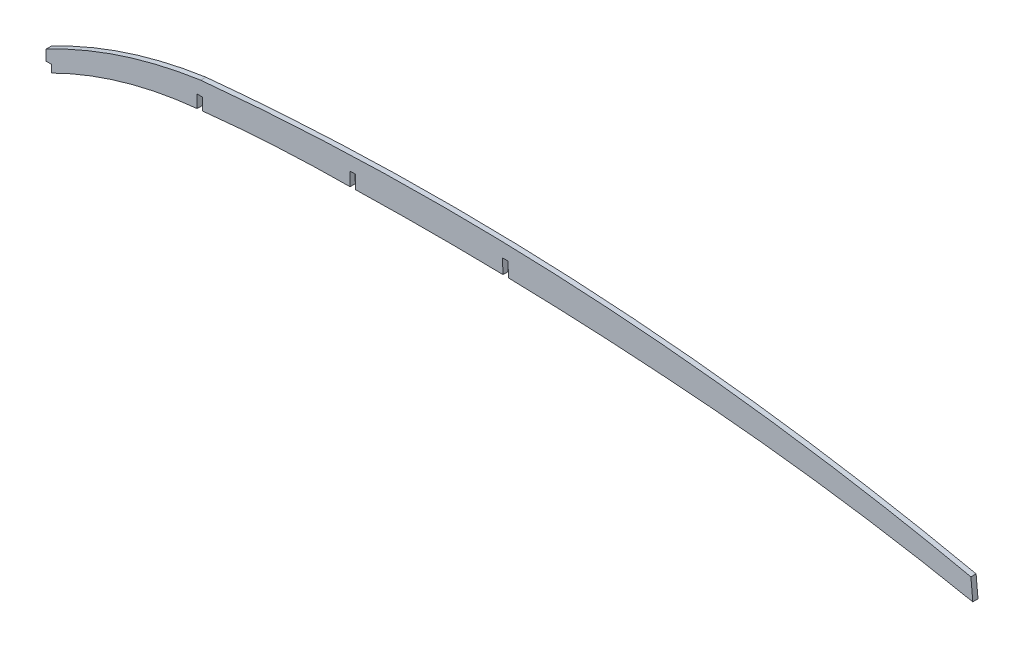
ISO-10303-21;
HEADER;
FILE_DESCRIPTION(('STEP AP214'),'2;1');
FILE_NAME('part.step','',(''),(''),'','','');
FILE_SCHEMA(('AUTOMOTIVE_DESIGN { 1 0 10303 214 1 1 1 1 }'));
ENDSEC;
DATA;
#1=APPLICATION_CONTEXT('core data for automotive mechanical design processes');
#2=APPLICATION_PROTOCOL_DEFINITION('international standard','automotive_design',2000,#1);
#3=PRODUCT_CONTEXT('',#1,'mechanical');
#4=PRODUCT('Part','Part','',(#3));
#5=PRODUCT_RELATED_PRODUCT_CATEGORY('part','',(#4));
#6=PRODUCT_DEFINITION_FORMATION('','',#4);
#7=PRODUCT_DEFINITION_CONTEXT('part definition',#1,'design');
#8=PRODUCT_DEFINITION('design','',#6,#7);
#9=PRODUCT_DEFINITION_SHAPE('','',#8);
#10=(LENGTH_UNIT() NAMED_UNIT(*) SI_UNIT(.MILLI.,.METRE.));
#11=(NAMED_UNIT(*) PLANE_ANGLE_UNIT() SI_UNIT($,.RADIAN.));
#12=(NAMED_UNIT(*) SI_UNIT($,.STERADIAN.) SOLID_ANGLE_UNIT());
#13=UNCERTAINTY_MEASURE_WITH_UNIT(LENGTH_MEASURE(1.E-05),#10,'distance_accuracy_value','');
#14=(GEOMETRIC_REPRESENTATION_CONTEXT(3) GLOBAL_UNCERTAINTY_ASSIGNED_CONTEXT((#13)) GLOBAL_UNIT_ASSIGNED_CONTEXT((#10,
#11,#12)) REPRESENTATION_CONTEXT('',''));
#15=CARTESIAN_POINT('',(0.,0.,0.));
#16=DIRECTION('',(0.,0.,1.));
#17=DIRECTION('',(1.,0.,0.));
#18=AXIS2_PLACEMENT_3D('',#15,#16,#17);
#19=CARTESIAN_POINT('',(236.842908731335,-1854.33285745886,-1.5875));
#20=DIRECTION('',(0.,0.,1.));
#21=DIRECTION('',(1.,0.,0.));
#22=AXIS2_PLACEMENT_3D('',#19,#20,#21);
#23=CYLINDRICAL_SURFACE('',#22,1973.72186122721);
#24=DIRECTION('',(0.,0.,1.));
#25=VECTOR('',#24,1.);
#26=CARTESIAN_POINT('',(189.115059370684,118.811850331623,-1.5875));
#27=LINE('',#26,#25);
#28=CARTESIAN_POINT('',(189.115059370684,118.811850331623,-1.5875));
#29=VERTEX_POINT('',#28);
#30=CARTESIAN_POINT('',(189.115059370684,118.811850331623,1.5875));
#31=VERTEX_POINT('',#30);
#32=EDGE_CURVE('E61',#29,#31,#27,.T.);
#33=ORIENTED_EDGE('',*,*,#32,.F.);
#34=CARTESIAN_POINT('',(236.842908731335,-1854.33285745886,-1.5875));
#35=DIRECTION('',(0.,0.,1.));
#36=DIRECTION('',(1.,0.,0.));
#37=AXIS2_PLACEMENT_3D('',#34,#35,#36);
#38=CIRCLE('',#37,1973.72186122721);
#39=CARTESIAN_POINT('',(279.152088981059,118.935476740212,-1.5875));
#40=VERTEX_POINT('',#39);
#41=EDGE_CURVE('E430',#29,#40,#38,.F.);
#42=ORIENTED_EDGE('',*,*,#41,.T.);
#43=DIRECTION('',(0.,0.,1.));
#44=VECTOR('',#43,1.);
#45=CARTESIAN_POINT('',(279.152088981059,118.935476740212,-1.5875));
#46=LINE('',#45,#44);
#47=CARTESIAN_POINT('',(279.152088981059,118.935476740212,1.5875));
#48=VERTEX_POINT('',#47);
#49=EDGE_CURVE('E238',#48,#40,#46,.F.);
#50=ORIENTED_EDGE('',*,*,#49,.F.);
#51=CARTESIAN_POINT('',(236.842908731335,-1854.33285745886,1.5875));
#52=DIRECTION('',(0.,0.,1.));
#53=DIRECTION('',(1.,0.,0.));
#54=AXIS2_PLACEMENT_3D('',#51,#52,#53);
#55=CIRCLE('',#54,1973.72186122721);
#56=EDGE_CURVE('E346',#31,#48,#55,.F.);
#57=ORIENTED_EDGE('',*,*,#56,.F.);
#58=EDGE_LOOP('',(#33,#42,#50,#57));
#59=FACE_BOUND('',#58,.T.);
#60=ADVANCED_FACE('F38',(#59),#23,.F.);
#61=CARTESIAN_POINT('',(569.494849028275,51.9104685304649,-1.5875));
#62=DIRECTION('',(0.995871386262189,0.0907754483559642,0.));
#63=DIRECTION('',(-0.0907754483559642,0.995871386262189,0.));
#64=AXIS2_PLACEMENT_3D('',#61,#62,#63);
#65=PLANE('',#64);
#66=DIRECTION('',(-0.0907754483559642,0.995871386262189,0.));
#67=VECTOR('',#66,1.);
#68=CARTESIAN_POINT('',(569.494849028275,51.9104685304649,1.5875));
#69=LINE('',#68,#67);
#70=CARTESIAN_POINT('',(566.085246421805,89.3162399786314,1.5875));
#71=VERTEX_POINT('',#70);
#72=CARTESIAN_POINT('',(564.932089986396,101.967188210855,1.5875));
#73=VERTEX_POINT('',#72);
#74=EDGE_CURVE('E269',#71,#73,#69,.T.);
#75=ORIENTED_EDGE('',*,*,#74,.F.);
#76=DIRECTION('',(0.,0.,1.));
#77=VECTOR('',#76,1.);
#78=CARTESIAN_POINT('',(566.085246421805,89.3162399786314,-1.5875));
#79=LINE('',#78,#77);
#80=CARTESIAN_POINT('',(566.085246421805,89.3162399786314,-1.5875));
#81=VERTEX_POINT('',#80);
#82=EDGE_CURVE('E318',#81,#71,#79,.T.);
#83=ORIENTED_EDGE('',*,*,#82,.F.);
#84=DIRECTION('',(-0.0907754483559642,0.995871386262189,0.));
#85=VECTOR('',#84,1.);
#86=CARTESIAN_POINT('',(569.494849028275,51.9104685304649,-1.5875));
#87=LINE('',#86,#85);
#88=CARTESIAN_POINT('',(564.932089986396,101.967188210855,-1.5875));
#89=VERTEX_POINT('',#88);
#90=EDGE_CURVE('E354',#81,#89,#87,.T.);
#91=ORIENTED_EDGE('',*,*,#90,.T.);
#92=DIRECTION('',(0.,0.,1.));
#93=VECTOR('',#92,1.);
#94=CARTESIAN_POINT('',(564.932089986396,101.967188210855,-1.5875));
#95=LINE('',#94,#93);
#96=EDGE_CURVE('E366',#89,#73,#95,.T.);
#97=ORIENTED_EDGE('',*,*,#96,.T.);
#98=EDGE_LOOP('',(#75,#83,#91,#97));
#99=FACE_BOUND('',#98,.T.);
#100=ADVANCED_FACE('F40',(#99),#65,.T.);
#101=CARTESIAN_POINT('',(283.231887302142,-1315.96010821101,-1.5875));
#102=DIRECTION('',(0.,0.,1.));
#103=DIRECTION('',(1.,0.,0.));
#104=AXIS2_PLACEMENT_3D('',#101,#102,#103);
#105=CYLINDRICAL_SURFACE('',#104,1433.46002300255);
#106=CARTESIAN_POINT('',(283.231887302142,-1315.96010821101,1.5875));
#107=DIRECTION('',(0.,0.,1.));
#108=DIRECTION('',(1.,0.,0.));
#109=AXIS2_PLACEMENT_3D('',#106,#107,#108);
#110=CIRCLE('',#109,1433.46002300255);
#111=CARTESIAN_POINT('',(373.101055051591,114.680017828539,1.5875));
#112=VERTEX_POINT('',#111);
#113=EDGE_CURVE('E351',#112,#71,#110,.F.);
#114=ORIENTED_EDGE('',*,*,#113,.F.);
#115=DIRECTION('',(0.,0.,1.));
#116=VECTOR('',#115,1.);
#117=CARTESIAN_POINT('',(373.101055051591,114.680017828539,-1.5875));
#118=LINE('',#117,#116);
#119=CARTESIAN_POINT('',(373.101055051591,114.680017828539,-1.5875));
#120=VERTEX_POINT('',#119);
#121=EDGE_CURVE('E356',#120,#112,#118,.T.);
#122=ORIENTED_EDGE('',*,*,#121,.F.);
#123=CARTESIAN_POINT('',(283.231887302142,-1315.96010821101,-1.5875));
#124=DIRECTION('',(0.,0.,1.));
#125=DIRECTION('',(1.,0.,0.));
#126=AXIS2_PLACEMENT_3D('',#123,#124,#125);
#127=CIRCLE('',#126,1433.46002300255);
#128=EDGE_CURVE('E432',#120,#81,#127,.F.);
#129=ORIENTED_EDGE('',*,*,#128,.T.);
#130=ORIENTED_EDGE('',*,*,#82,.T.);
#131=EDGE_LOOP('',(#114,#122,#129,#130));
#132=FACE_BOUND('',#131,.T.);
#133=ADVANCED_FACE('F400',(#132),#105,.F.);
#134=DIRECTION('',(0.,0.,1.));
#135=VECTOR('',#134,1.);
#136=CARTESIAN_POINT('',(282.536664840303,118.860003398597,-1.5875));
#137=LINE('',#136,#135);
#138=CARTESIAN_POINT('',(282.536664840303,118.860003398598,-1.5875));
#139=VERTEX_POINT('',#138);
#140=CARTESIAN_POINT('',(282.536664840303,118.860003398598,1.5875));
#141=VERTEX_POINT('',#140);
#142=EDGE_CURVE('E53',#139,#141,#137,.T.);
#143=ORIENTED_EDGE('',*,*,#142,.F.);
#144=EDGE_CURVE('E433',#139,#120,#38,.F.);
#145=ORIENTED_EDGE('',*,*,#144,.T.);
#146=ORIENTED_EDGE('',*,*,#121,.T.);
#147=EDGE_CURVE('E343',#141,#112,#55,.F.);
#148=ORIENTED_EDGE('',*,*,#147,.F.);
#149=EDGE_LOOP('',(#143,#145,#146,#148));
#150=FACE_BOUND('',#149,.T.);
#151=ADVANCED_FACE('F403',(#150),#23,.F.);
#152=CARTESIAN_POINT('',(190.018097922332,-770.259086533944,-1.5875));
#153=DIRECTION('',(0.,0.,1.));
#154=DIRECTION('',(1.,0.,0.));
#155=AXIS2_PLACEMENT_3D('',#152,#153,#154);
#156=CYLINDRICAL_SURFACE('',#155,889.);
#157=DIRECTION('',(0.,0.,1.));
#158=VECTOR('',#157,1.);
#159=CARTESIAN_POINT('',(95.6691,113.720136406873,-1.5875));
#160=LINE('',#159,#158);
#161=CARTESIAN_POINT('',(95.6691,113.720136406873,-1.5875));
#162=VERTEX_POINT('',#161);
#163=CARTESIAN_POINT('',(95.6691,113.720136406873,1.5875));
#164=VERTEX_POINT('',#163);
#165=EDGE_CURVE('E255',#162,#164,#160,.T.);
#166=ORIENTED_EDGE('',*,*,#165,.F.);
#167=CARTESIAN_POINT('',(190.018097922332,-770.259086533944,-1.5875));
#168=DIRECTION('',(0.,0.,1.));
#169=DIRECTION('',(1.,0.,0.));
#170=AXIS2_PLACEMENT_3D('',#167,#168,#169);
#171=CIRCLE('',#170,889.);
#172=CARTESIAN_POINT('',(185.737819943483,118.730609255846,-1.5875));
#173=VERTEX_POINT('',#172);
#174=EDGE_CURVE('E337',#162,#173,#171,.F.);
#175=ORIENTED_EDGE('',*,*,#174,.T.);
#176=DIRECTION('',(0.,0.,1.));
#177=VECTOR('',#176,1.);
#178=CARTESIAN_POINT('',(185.737819943483,118.730609255846,-1.5875));
#179=LINE('',#178,#177);
#180=CARTESIAN_POINT('',(185.737819943483,118.730609255846,1.5875));
#181=VERTEX_POINT('',#180);
#182=EDGE_CURVE('E250',#181,#173,#179,.F.);
#183=ORIENTED_EDGE('',*,*,#182,.F.);
#184=CARTESIAN_POINT('',(190.018097922332,-770.259086533944,1.5875));
#185=DIRECTION('',(0.,0.,1.));
#186=DIRECTION('',(1.,0.,0.));
#187=AXIS2_PLACEMENT_3D('',#184,#185,#186);
#188=CIRCLE('',#187,889.);
#189=EDGE_CURVE('E341',#164,#181,#188,.F.);
#190=ORIENTED_EDGE('',*,*,#189,.F.);
#191=EDGE_LOOP('',(#166,#175,#183,#190));
#192=FACE_BOUND('',#191,.T.);
#193=ADVANCED_FACE('F339',(#192),#156,.F.);
#194=CARTESIAN_POINT('',(117.154868986009,-139.425807428127,-1.5875));
#195=DIRECTION('',(0.,0.,1.));
#196=DIRECTION('',(1.,0.,0.));
#197=AXIS2_PLACEMENT_3D('',#194,#195,#196);
#198=CYLINDRICAL_SURFACE('',#197,254.);
#199=DIRECTION('',(0.,0.,1.));
#200=VECTOR('',#199,1.);
#201=CARTESIAN_POINT('',(3.302,87.6282042599611,-1.5875));
#202=LINE('',#201,#200);
#203=CARTESIAN_POINT('',(3.302,87.6282042599611,-1.5875));
#204=VERTEX_POINT('',#203);
#205=CARTESIAN_POINT('',(3.302,87.6282042599611,1.5875));
#206=VERTEX_POINT('',#205);
#207=EDGE_CURVE('E190',#204,#206,#202,.T.);
#208=ORIENTED_EDGE('',*,*,#207,.F.);
#209=CARTESIAN_POINT('',(117.154868986009,-139.425807428127,-1.5875));
#210=DIRECTION('',(0.,0.,1.));
#211=DIRECTION('',(1.,0.,0.));
#212=AXIS2_PLACEMENT_3D('',#209,#210,#211);
#213=CIRCLE('',#212,254.);
#214=CARTESIAN_POINT('',(92.2909,113.354300662408,-1.5875));
#215=VERTEX_POINT('',#214);
#216=EDGE_CURVE('E440',#204,#215,#213,.F.);
#217=ORIENTED_EDGE('',*,*,#216,.T.);
#218=DIRECTION('',(0.,0.,1.));
#219=VECTOR('',#218,1.);
#220=CARTESIAN_POINT('',(92.2909,113.354300662408,-1.5875));
#221=LINE('',#220,#219);
#222=CARTESIAN_POINT('',(92.2909,113.354300662408,1.5875));
#223=VERTEX_POINT('',#222);
#224=EDGE_CURVE('E263',#223,#215,#221,.F.);
#225=ORIENTED_EDGE('',*,*,#224,.F.);
#226=CARTESIAN_POINT('',(117.154868986009,-139.425807428127,1.5875));
#227=DIRECTION('',(0.,0.,1.));
#228=DIRECTION('',(1.,0.,0.));
#229=AXIS2_PLACEMENT_3D('',#226,#227,#228);
#230=CIRCLE('',#229,254.);
#231=EDGE_CURVE('E344',#206,#223,#230,.F.);
#232=ORIENTED_EDGE('',*,*,#231,.F.);
#233=EDGE_LOOP('',(#208,#217,#225,#232));
#234=FACE_BOUND('',#233,.T.);
#235=ADVANCED_FACE('F410',(#234),#198,.F.);
#236=CARTESIAN_POINT('',(-1.32514179680361E-12,0.,-1.5875));
#237=DIRECTION('',(1.,0.,0.));
#238=DIRECTION('',(0.,1.,0.));
#239=AXIS2_PLACEMENT_3D('',#236,#237,#238);
#240=PLANE('',#239);
#241=DIRECTION('',(0.,1.,0.));
#242=VECTOR('',#241,1.);
#243=CARTESIAN_POINT('',(-1.32514179680361E-12,0.,-1.5875));
#244=LINE('',#243,#242);
#245=CARTESIAN_POINT('',(0.,92.2921953426092,-1.5875));
#246=VERTEX_POINT('',#245);
#247=CARTESIAN_POINT('',(-1.28836091897742E-12,98.6499639472536,-1.5875));
#248=VERTEX_POINT('',#247);
#249=EDGE_CURVE('E274',#246,#248,#244,.T.);
#250=ORIENTED_EDGE('',*,*,#249,.F.);
#251=DIRECTION('',(0.,0.,1.));
#252=VECTOR('',#251,1.);
#253=CARTESIAN_POINT('',(0.,92.2921953426092,-1.5925));
#254=LINE('',#253,#252);
#255=CARTESIAN_POINT('',(0.,92.2921953426092,1.5875));
#256=VERTEX_POINT('',#255);
#257=EDGE_CURVE('E185',#246,#256,#254,.T.);
#258=ORIENTED_EDGE('',*,*,#257,.T.);
#259=DIRECTION('',(0.,1.,0.));
#260=VECTOR('',#259,1.);
#261=CARTESIAN_POINT('',(-1.32514179680361E-12,0.,1.5875));
#262=LINE('',#261,#260);
#263=CARTESIAN_POINT('',(-1.28836091897742E-12,98.6499639472536,1.5875));
#264=VERTEX_POINT('',#263);
#265=EDGE_CURVE('E197',#256,#264,#262,.T.);
#266=ORIENTED_EDGE('',*,*,#265,.T.);
#267=DIRECTION('',(0.,0.,1.));
#268=VECTOR('',#267,1.);
#269=CARTESIAN_POINT('',(-1.28836091897742E-12,98.6499639472536,-1.5875));
#270=LINE('',#269,#268);
#271=EDGE_CURVE('E359',#248,#264,#270,.T.);
#272=ORIENTED_EDGE('',*,*,#271,.F.);
#273=EDGE_LOOP('',(#250,#258,#266,#272));
#274=FACE_BOUND('',#273,.T.);
#275=ADVANCED_FACE('F412',(#274),#240,.F.);
#276=CARTESIAN_POINT('',(136.51719861133,-159.58532504965,-1.5875));
#277=DIRECTION('',(0.,0.,1.));
#278=DIRECTION('',(1.,0.,0.));
#279=AXIS2_PLACEMENT_3D('',#276,#277,#278);
#280=CYLINDRICAL_SURFACE('',#279,292.1);
#281=CARTESIAN_POINT('',(136.51719861133,-159.58532504965,1.5875));
#282=DIRECTION('',(0.,0.,1.));
#283=DIRECTION('',(1.,0.,0.));
#284=AXIS2_PLACEMENT_3D('',#281,#282,#283);
#285=CIRCLE('',#284,292.1);
#286=CARTESIAN_POINT('',(94.4926456918244,129.475822377526,1.5875));
#287=VERTEX_POINT('',#286);
#288=EDGE_CURVE('E310',#264,#287,#285,.F.);
#289=ORIENTED_EDGE('',*,*,#288,.T.);
#290=DIRECTION('',(0.,0.,1.));
#291=VECTOR('',#290,1.);
#292=CARTESIAN_POINT('',(94.4926456918244,129.475822377526,-1.5875));
#293=LINE('',#292,#291);
#294=CARTESIAN_POINT('',(94.4926456918244,129.475822377526,-1.5875));
#295=VERTEX_POINT('',#294);
#296=EDGE_CURVE('E361',#295,#287,#293,.T.);
#297=ORIENTED_EDGE('',*,*,#296,.F.);
#298=CARTESIAN_POINT('',(136.51719861133,-159.58532504965,-1.5875));
#299=DIRECTION('',(0.,0.,1.));
#300=DIRECTION('',(1.,0.,0.));
#301=AXIS2_PLACEMENT_3D('',#298,#299,#300);
#302=CIRCLE('',#301,292.1);
#303=EDGE_CURVE('E369',#248,#295,#302,.F.);
#304=ORIENTED_EDGE('',*,*,#303,.F.);
#305=ORIENTED_EDGE('',*,*,#271,.T.);
#306=EDGE_LOOP('',(#289,#297,#304,#305));
#307=FACE_BOUND('',#306,.T.);
#308=ADVANCED_FACE('F284',(#307),#280,.T.);
#309=CARTESIAN_POINT('',(564.932089986396,101.967188210855,-1.5875));
#310=CARTESIAN_POINT('',(526.305455218405,110.358765647728,-1.5875));
#311=CARTESIAN_POINT('',(487.40569380784,117.234573225275,-1.5875));
#312=CARTESIAN_POINT('',(438.439550098732,123.934433666385,-1.5875));
#313=CARTESIAN_POINT('',(428.624759846768,125.179975832053,-1.5875));
#314=CARTESIAN_POINT('',(408.99898404678,127.47653258551,-1.5875));
#315=CARTESIAN_POINT('',(399.184721149519,128.528085596109,-1.5875));
#316=CARTESIAN_POINT('',(369.737829991562,131.394153114278,-1.5875));
#317=CARTESIAN_POINT('',(350.101100843674,132.920187182947,-1.5875));
#318=CARTESIAN_POINT('',(291.174630326811,136.352842591056,-1.5875));
#319=CARTESIAN_POINT('',(251.86863030514,137.11573501395,-1.5875));
#320=CARTESIAN_POINT('',(173.213311456312,135.594221206513,-1.5875));
#321=CARTESIAN_POINT('',(133.863993721209,133.309891797542,-1.5875));
#322=CARTESIAN_POINT('',(94.4926456918244,129.475822377526,-1.5875));
#323=B_SPLINE_CURVE_WITH_KNOTS('',3,(#309,#310,#311,#312,#313,#314,#315,#316,#317,#318,#319,
#320,#321,#322),.UNSPECIFIED.,.F.,.F.,(4,2,2,2,2,2,4),(0.,0.25,0.3125,0.375,0.5,0.75,1.),.UNSPECIFIED.);
#324=DIRECTION('',(0.,0.,1.));
#325=VECTOR('',#324,1.);
#326=SURFACE_OF_LINEAR_EXTRUSION('',#323,#325);
#327=CARTESIAN_POINT('',(94.4926456918244,129.475822377526,1.5875));
#328=CARTESIAN_POINT('',(133.863993721209,133.309891797542,1.5875));
#329=CARTESIAN_POINT('',(173.213311456312,135.594221206513,1.5875));
#330=CARTESIAN_POINT('',(251.86863030514,137.11573501395,1.5875));
#331=CARTESIAN_POINT('',(291.174630326811,136.352842591056,1.5875));
#332=CARTESIAN_POINT('',(350.101100843674,132.920187182947,1.5875));
#333=CARTESIAN_POINT('',(369.737829991562,131.394153114278,1.5875));
#334=CARTESIAN_POINT('',(399.184721149519,128.528085596109,1.5875));
#335=CARTESIAN_POINT('',(408.99898404678,127.47653258551,1.5875));
#336=CARTESIAN_POINT('',(428.624759846768,125.179975832053,1.5875));
#337=CARTESIAN_POINT('',(438.439550098732,123.934433666385,1.5875));
#338=CARTESIAN_POINT('',(487.40569380784,117.234573225275,1.5875));
#339=CARTESIAN_POINT('',(526.305455218405,110.358765647728,1.5875));
#340=CARTESIAN_POINT('',(564.932089986396,101.967188210855,1.5875));
#341=B_SPLINE_CURVE_WITH_KNOTS('',3,(#327,#328,#329,#330,#331,#332,#333,#334,#335,#336,#337,
#338,#339,#340),.UNSPECIFIED.,.F.,.F.,(4,2,2,2,2,2,4),(0.,0.25,0.5,0.625,0.6875,0.75,1.),.UNSPECIFIED.);
#342=EDGE_CURVE('E307',#73,#287,#341,.F.);
#343=ORIENTED_EDGE('',*,*,#342,.F.);
#344=ORIENTED_EDGE('',*,*,#96,.F.);
#345=CARTESIAN_POINT('',(564.932089986396,101.967188210855,-1.5875));
#346=CARTESIAN_POINT('',(526.305455218405,110.358765647728,-1.5875));
#347=CARTESIAN_POINT('',(487.40569380784,117.234573225275,-1.5875));
#348=CARTESIAN_POINT('',(438.439550098732,123.934433666385,-1.5875));
#349=CARTESIAN_POINT('',(428.624759846768,125.179975832053,-1.5875));
#350=CARTESIAN_POINT('',(408.99898404678,127.47653258551,-1.5875));
#351=CARTESIAN_POINT('',(399.184721149519,128.528085596109,-1.5875));
#352=CARTESIAN_POINT('',(369.737829991562,131.394153114278,-1.5875));
#353=CARTESIAN_POINT('',(350.101100843674,132.920187182947,-1.5875));
#354=CARTESIAN_POINT('',(291.174630326811,136.352842591056,-1.5875));
#355=CARTESIAN_POINT('',(251.86863030514,137.11573501395,-1.5875));
#356=CARTESIAN_POINT('',(173.213311456312,135.594221206513,-1.5875));
#357=CARTESIAN_POINT('',(133.863993721209,133.309891797542,-1.5875));
#358=CARTESIAN_POINT('',(94.4926456918244,129.475822377526,-1.5875));
#359=B_SPLINE_CURVE_WITH_KNOTS('',3,(#345,#346,#347,#348,#349,#350,#351,#352,#353,#354,#355,
#356,#357,#358),.UNSPECIFIED.,.F.,.F.,(4,2,2,2,2,2,4),(0.,0.25,0.3125,0.375,0.5,0.75,1.),.UNSPECIFIED.);
#360=EDGE_CURVE('E364',#89,#295,#359,.T.);
#361=ORIENTED_EDGE('',*,*,#360,.T.);
#362=ORIENTED_EDGE('',*,*,#296,.T.);
#363=EDGE_LOOP('',(#343,#344,#361,#362));
#364=FACE_BOUND('',#363,.T.);
#365=ADVANCED_FACE('F279',(#364),#326,.T.);
#366=CARTESIAN_POINT('',(0.,0.,-1.5875));
#367=DIRECTION('',(0.,0.,1.));
#368=DIRECTION('',(1.,0.,0.));
#369=AXIS2_PLACEMENT_3D('',#366,#367,#368);
#370=PLANE('',#369);
#371=DIRECTION('',(0.,1.,0.));
#372=VECTOR('',#371,1.);
#373=CARTESIAN_POINT('',(3.302,0.,-1.5875));
#374=LINE('',#373,#372);
#375=CARTESIAN_POINT('',(3.302,92.2921953426092,-1.5875));
#376=VERTEX_POINT('',#375);
#377=EDGE_CURVE('E265',#204,#376,#374,.T.);
#378=ORIENTED_EDGE('',*,*,#377,.T.);
#379=DIRECTION('',(-1.,0.,0.));
#380=VECTOR('',#379,1.);
#381=CARTESIAN_POINT('',(0.,92.2921953426092,-1.5875));
#382=LINE('',#381,#380);
#383=EDGE_CURVE('E182',#376,#246,#382,.T.);
#384=ORIENTED_EDGE('',*,*,#383,.T.);
#385=ORIENTED_EDGE('',*,*,#249,.T.);
#386=ORIENTED_EDGE('',*,*,#303,.T.);
#387=ORIENTED_EDGE('',*,*,#360,.F.);
#388=ORIENTED_EDGE('',*,*,#90,.F.);
#389=ORIENTED_EDGE('',*,*,#128,.F.);
#390=ORIENTED_EDGE('',*,*,#144,.F.);
#391=DIRECTION('',(-0.0430000788379681,0.999075068861159,0.));
#392=VECTOR('',#391,1.);
#393=CARTESIAN_POINT('',(287.120514834861,12.3576347350659,-1.5875));
#394=LINE('',#393,#392);
#395=CARTESIAN_POINT('',(282.155347854095,127.719621905079,-1.5875));
#396=VERTEX_POINT('',#395);
#397=EDGE_CURVE('E203',#139,#396,#394,.T.);
#398=ORIENTED_EDGE('',*,*,#397,.T.);
#399=DIRECTION('',(-0.999075068861158,-0.0430000788379695,0.));
#400=VECTOR('',#399,1.);
#401=CARTESIAN_POINT('',(-4.96516698076542,115.361987170013,-1.5875));
#402=LINE('',#401,#400);
#403=CARTESIAN_POINT('',(278.780272456468,127.574359038748,-1.5875));
#404=VERTEX_POINT('',#403);
#405=EDGE_CURVE('E232',#396,#404,#402,.T.);
#406=ORIENTED_EDGE('',*,*,#405,.T.);
#407=DIRECTION('',(0.0430000788379724,-0.999075068861158,0.));
#408=VECTOR('',#407,1.);
#409=CARTESIAN_POINT('',(283.745439437234,12.2123718687367,-1.5875));
#410=LINE('',#409,#408);
#411=EDGE_CURVE('E235',#404,#40,#410,.T.);
#412=ORIENTED_EDGE('',*,*,#411,.T.);
#413=ORIENTED_EDGE('',*,*,#41,.F.);
#414=DIRECTION('',(-0.0209302977680092,0.999780937323443,0.));
#415=VECTOR('',#414,1.);
#416=CARTESIAN_POINT('',(191.518434991743,4.00941618588141,-1.5875));
#417=LINE('',#416,#415);
#418=CARTESIAN_POINT('',(188.943559254568,127.003924268752,-1.5875));
#419=VERTEX_POINT('',#418);
#420=EDGE_CURVE('E240',#29,#419,#417,.T.);
#421=ORIENTED_EDGE('',*,*,#420,.T.);
#422=DIRECTION('',(-0.999780937323443,-0.0209302977680097,0.));
#423=VECTOR('',#422,1.);
#424=CARTESIAN_POINT('',(-2.57487573717513,122.99450808287,-1.5875));
#425=LINE('',#424,#423);
#426=CARTESIAN_POINT('',(185.566099292102,126.933217536832,-1.5875));
#427=VERTEX_POINT('',#426);
#428=EDGE_CURVE('E244',#419,#427,#425,.T.);
#429=ORIENTED_EDGE('',*,*,#428,.T.);
#430=DIRECTION('',(0.0209302977680093,-0.999780937323443,0.));
#431=VECTOR('',#430,1.);
#432=CARTESIAN_POINT('',(188.140975029277,3.93870945396153,-1.5875));
#433=LINE('',#432,#431);
#434=EDGE_CURVE('E247',#427,#173,#433,.T.);
#435=ORIENTED_EDGE('',*,*,#434,.T.);
#436=ORIENTED_EDGE('',*,*,#174,.F.);
#437=DIRECTION('',(0.,1.,0.));
#438=VECTOR('',#437,1.);
#439=CARTESIAN_POINT('',(95.6691,0.,-1.5875));
#440=LINE('',#439,#438);
#441=CARTESIAN_POINT('',(95.6691,121.061123802637,-1.5875));
#442=VERTEX_POINT('',#441);
#443=EDGE_CURVE('E252',#162,#442,#440,.T.);
#444=ORIENTED_EDGE('',*,*,#443,.T.);
#445=DIRECTION('',(-1.,0.,0.));
#446=VECTOR('',#445,1.);
#447=CARTESIAN_POINT('',(0.,121.061123802637,-1.5875));
#448=LINE('',#447,#446);
#449=CARTESIAN_POINT('',(92.2909,121.061123802637,-1.5875));
#450=VERTEX_POINT('',#449);
#451=EDGE_CURVE('E257',#442,#450,#448,.T.);
#452=ORIENTED_EDGE('',*,*,#451,.T.);
#453=DIRECTION('',(0.,-1.,0.));
#454=VECTOR('',#453,1.);
#455=CARTESIAN_POINT('',(92.2909,0.,-1.5875));
#456=LINE('',#455,#454);
#457=EDGE_CURVE('E260',#450,#215,#456,.T.);
#458=ORIENTED_EDGE('',*,*,#457,.T.);
#459=ORIENTED_EDGE('',*,*,#216,.F.);
#460=EDGE_LOOP('',(#378,#384,#385,#386,#387,#388,#389,#390,#398,#406,#412,#413,#421,#429,#435,
#436,#444,#452,#458,#459));
#461=FACE_BOUND('',#460,.T.);
#462=ADVANCED_FACE('F283',(#461),#370,.F.);
#463=CARTESIAN_POINT('',(0.,0.,1.5875));
#464=DIRECTION('',(0.,0.,1.));
#465=DIRECTION('',(1.,0.,0.));
#466=AXIS2_PLACEMENT_3D('',#463,#464,#465);
#467=PLANE('',#466);
#468=DIRECTION('',(-1.,0.,0.));
#469=VECTOR('',#468,1.);
#470=CARTESIAN_POINT('',(0.,92.2921953426092,1.5875));
#471=LINE('',#470,#469);
#472=CARTESIAN_POINT('',(3.302,92.2921953426092,1.5875));
#473=VERTEX_POINT('',#472);
#474=EDGE_CURVE('E179',#473,#256,#471,.T.);
#475=ORIENTED_EDGE('',*,*,#474,.F.);
#476=DIRECTION('',(0.,1.,0.));
#477=VECTOR('',#476,1.);
#478=CARTESIAN_POINT('',(3.302,0.,1.5875));
#479=LINE('',#478,#477);
#480=EDGE_CURVE('E11',#206,#473,#479,.T.);
#481=ORIENTED_EDGE('',*,*,#480,.F.);
#482=ORIENTED_EDGE('',*,*,#231,.T.);
#483=DIRECTION('',(0.,-1.,0.));
#484=VECTOR('',#483,1.);
#485=CARTESIAN_POINT('',(92.2909,121.061123802637,1.5875));
#486=LINE('',#485,#484);
#487=CARTESIAN_POINT('',(92.2909,121.061123802637,1.5875));
#488=VERTEX_POINT('',#487);
#489=EDGE_CURVE('E198',#488,#223,#486,.T.);
#490=ORIENTED_EDGE('',*,*,#489,.F.);
#491=DIRECTION('',(-1.,0.,0.));
#492=VECTOR('',#491,1.);
#493=CARTESIAN_POINT('',(92.2909,121.061123802637,1.5875));
#494=LINE('',#493,#492);
#495=CARTESIAN_POINT('',(95.6691,121.061123802637,1.5875));
#496=VERTEX_POINT('',#495);
#497=EDGE_CURVE('E200',#496,#488,#494,.T.);
#498=ORIENTED_EDGE('',*,*,#497,.F.);
#499=DIRECTION('',(0.,1.,0.));
#500=VECTOR('',#499,1.);
#501=CARTESIAN_POINT('',(95.6691,0.,1.5875));
#502=LINE('',#501,#500);
#503=EDGE_CURVE('E46',#164,#496,#502,.T.);
#504=ORIENTED_EDGE('',*,*,#503,.F.);
#505=ORIENTED_EDGE('',*,*,#189,.T.);
#506=DIRECTION('',(0.0209302977680093,-0.999780937323443,0.));
#507=VECTOR('',#506,1.);
#508=CARTESIAN_POINT('',(185.566099292102,126.933217536832,1.5875));
#509=LINE('',#508,#507);
#510=CARTESIAN_POINT('',(185.566099292102,126.933217536832,1.5875));
#511=VERTEX_POINT('',#510);
#512=EDGE_CURVE('E209',#511,#181,#509,.T.);
#513=ORIENTED_EDGE('',*,*,#512,.F.);
#514=DIRECTION('',(-0.999780937323443,-0.0209302977680097,0.));
#515=VECTOR('',#514,1.);
#516=CARTESIAN_POINT('',(185.566099292102,126.933217536832,1.5875));
#517=LINE('',#516,#515);
#518=CARTESIAN_POINT('',(188.943559254568,127.003924268752,1.5875));
#519=VERTEX_POINT('',#518);
#520=EDGE_CURVE('E214',#519,#511,#517,.T.);
#521=ORIENTED_EDGE('',*,*,#520,.F.);
#522=DIRECTION('',(-0.0209302977680092,0.999780937323443,0.));
#523=VECTOR('',#522,1.);
#524=CARTESIAN_POINT('',(191.518434991743,4.00941618588141,1.5875));
#525=LINE('',#524,#523);
#526=EDGE_CURVE('E317',#31,#519,#525,.T.);
#527=ORIENTED_EDGE('',*,*,#526,.F.);
#528=ORIENTED_EDGE('',*,*,#56,.T.);
#529=DIRECTION('',(0.0430000788379724,-0.999075068861158,0.));
#530=VECTOR('',#529,1.);
#531=CARTESIAN_POINT('',(278.780272456468,127.574359038748,1.5875));
#532=LINE('',#531,#530);
#533=CARTESIAN_POINT('',(278.780272456468,127.574359038748,1.5875));
#534=VERTEX_POINT('',#533);
#535=EDGE_CURVE('E217',#534,#48,#532,.T.);
#536=ORIENTED_EDGE('',*,*,#535,.F.);
#537=DIRECTION('',(-0.999075068861158,-0.0430000788379695,0.));
#538=VECTOR('',#537,1.);
#539=CARTESIAN_POINT('',(278.780272456468,127.574359038748,1.5875));
#540=LINE('',#539,#538);
#541=CARTESIAN_POINT('',(282.155347854095,127.719621905079,1.5875));
#542=VERTEX_POINT('',#541);
#543=EDGE_CURVE('E223',#542,#534,#540,.T.);
#544=ORIENTED_EDGE('',*,*,#543,.F.);
#545=DIRECTION('',(-0.0430000788379681,0.999075068861159,0.));
#546=VECTOR('',#545,1.);
#547=CARTESIAN_POINT('',(287.120514834861,12.3576347350659,1.5875));
#548=LINE('',#547,#546);
#549=EDGE_CURVE('E315',#141,#542,#548,.T.);
#550=ORIENTED_EDGE('',*,*,#549,.F.);
#551=ORIENTED_EDGE('',*,*,#147,.T.);
#552=ORIENTED_EDGE('',*,*,#113,.T.);
#553=ORIENTED_EDGE('',*,*,#74,.T.);
#554=ORIENTED_EDGE('',*,*,#342,.T.);
#555=ORIENTED_EDGE('',*,*,#288,.F.);
#556=ORIENTED_EDGE('',*,*,#265,.F.);
#557=EDGE_LOOP('',(#475,#481,#482,#490,#498,#504,#505,#513,#521,#527,#528,#536,#544,#550,#551,
#552,#553,#554,#555,#556));
#558=FACE_BOUND('',#557,.T.);
#559=ADVANCED_FACE('F195',(#558),#467,.T.);
#560=CARTESIAN_POINT('',(278.780272456468,127.574359038748,-1.5925));
#561=DIRECTION('',(-0.0430000788379695,0.999075068861158,0.));
#562=DIRECTION('',(-0.999075068861158,-0.0430000788379695,0.));
#563=AXIS2_PLACEMENT_3D('',#560,#561,#562);
#564=PLANE('',#563);
#565=DIRECTION('',(0.,0.,1.));
#566=VECTOR('',#565,1.);
#567=CARTESIAN_POINT('',(282.155347854095,127.719621905079,-1.5925));
#568=LINE('',#567,#566);
#569=EDGE_CURVE('E221',#396,#542,#568,.T.);
#570=ORIENTED_EDGE('',*,*,#569,.T.);
#571=ORIENTED_EDGE('',*,*,#543,.T.);
#572=DIRECTION('',(0.,0.,1.));
#573=VECTOR('',#572,1.);
#574=CARTESIAN_POINT('',(278.780272456468,127.574359038748,-1.5925));
#575=LINE('',#574,#573);
#576=EDGE_CURVE('E224',#404,#534,#575,.T.);
#577=ORIENTED_EDGE('',*,*,#576,.F.);
#578=ORIENTED_EDGE('',*,*,#405,.F.);
#579=EDGE_LOOP('',(#570,#571,#577,#578));
#580=FACE_BOUND('',#579,.T.);
#581=ADVANCED_FACE('F397',(#580),#564,.F.);
#582=CARTESIAN_POINT('',(278.780272456468,127.574359038748,-1.5925));
#583=DIRECTION('',(-0.999075068861158,-0.0430000788379724,0.));
#584=DIRECTION('',(0.0430000788379724,-0.999075068861158,0.));
#585=AXIS2_PLACEMENT_3D('',#582,#583,#584);
#586=PLANE('',#585);
#587=ORIENTED_EDGE('',*,*,#49,.T.);
#588=ORIENTED_EDGE('',*,*,#411,.F.);
#589=ORIENTED_EDGE('',*,*,#576,.T.);
#590=ORIENTED_EDGE('',*,*,#535,.T.);
#591=EDGE_LOOP('',(#587,#588,#589,#590));
#592=FACE_BOUND('',#591,.T.);
#593=ADVANCED_FACE('F467',(#592),#586,.F.);
#594=CARTESIAN_POINT('',(282.155347854095,127.719621905079,-1.5925));
#595=DIRECTION('',(0.999075068861158,0.0430000788379681,0.));
#596=DIRECTION('',(-0.0430000788379681,0.999075068861159,0.));
#597=AXIS2_PLACEMENT_3D('',#594,#595,#596);
#598=PLANE('',#597);
#599=ORIENTED_EDGE('',*,*,#142,.T.);
#600=ORIENTED_EDGE('',*,*,#549,.T.);
#601=ORIENTED_EDGE('',*,*,#569,.F.);
#602=ORIENTED_EDGE('',*,*,#397,.F.);
#603=EDGE_LOOP('',(#599,#600,#601,#602));
#604=FACE_BOUND('',#603,.T.);
#605=ADVANCED_FACE('F465',(#604),#598,.F.);
#606=CARTESIAN_POINT('',(185.566099292102,126.933217536832,-1.5925));
#607=DIRECTION('',(-0.0209302977680096,0.999780937323443,0.));
#608=DIRECTION('',(-0.999780937323443,-0.0209302977680097,0.));
#609=AXIS2_PLACEMENT_3D('',#606,#607,#608);
#610=PLANE('',#609);
#611=DIRECTION('',(0.,0.,1.));
#612=VECTOR('',#611,1.);
#613=CARTESIAN_POINT('',(188.943559254568,127.003924268752,-1.5925));
#614=LINE('',#613,#612);
#615=EDGE_CURVE('E212',#419,#519,#614,.T.);
#616=ORIENTED_EDGE('',*,*,#615,.T.);
#617=ORIENTED_EDGE('',*,*,#520,.T.);
#618=DIRECTION('',(0.,0.,1.));
#619=VECTOR('',#618,1.);
#620=CARTESIAN_POINT('',(185.566099292102,126.933217536832,-1.5925));
#621=LINE('',#620,#619);
#622=EDGE_CURVE('E215',#427,#511,#621,.T.);
#623=ORIENTED_EDGE('',*,*,#622,.F.);
#624=ORIENTED_EDGE('',*,*,#428,.F.);
#625=EDGE_LOOP('',(#616,#617,#623,#624));
#626=FACE_BOUND('',#625,.T.);
#627=ADVANCED_FACE('F459',(#626),#610,.F.);
#628=CARTESIAN_POINT('',(185.566099292102,126.933217536832,-1.5925));
#629=DIRECTION('',(-0.999780937323443,-0.0209302977680093,0.));
#630=DIRECTION('',(0.0209302977680093,-0.999780937323443,0.));
#631=AXIS2_PLACEMENT_3D('',#628,#629,#630);
#632=PLANE('',#631);
#633=ORIENTED_EDGE('',*,*,#182,.T.);
#634=ORIENTED_EDGE('',*,*,#434,.F.);
#635=ORIENTED_EDGE('',*,*,#622,.T.);
#636=ORIENTED_EDGE('',*,*,#512,.T.);
#637=EDGE_LOOP('',(#633,#634,#635,#636));
#638=FACE_BOUND('',#637,.T.);
#639=ADVANCED_FACE('F456',(#638),#632,.F.);
#640=CARTESIAN_POINT('',(188.943559254568,127.003924268752,-1.5925));
#641=DIRECTION('',(0.999780937323443,0.0209302977680092,0.));
#642=DIRECTION('',(-0.0209302977680092,0.999780937323443,0.));
#643=AXIS2_PLACEMENT_3D('',#640,#641,#642);
#644=PLANE('',#643);
#645=ORIENTED_EDGE('',*,*,#32,.T.);
#646=ORIENTED_EDGE('',*,*,#526,.T.);
#647=ORIENTED_EDGE('',*,*,#615,.F.);
#648=ORIENTED_EDGE('',*,*,#420,.F.);
#649=EDGE_LOOP('',(#645,#646,#647,#648));
#650=FACE_BOUND('',#649,.T.);
#651=ADVANCED_FACE('F451',(#650),#644,.F.);
#652=CARTESIAN_POINT('',(92.2909,121.061123802637,-1.5925));
#653=DIRECTION('',(0.,1.,0.));
#654=DIRECTION('',(0.,0.,1.));
#655=AXIS2_PLACEMENT_3D('',#652,#653,#654);
#656=PLANE('',#655);
#657=DIRECTION('',(0.,0.,1.));
#658=VECTOR('',#657,1.);
#659=CARTESIAN_POINT('',(95.6691,121.061123802637,-1.5925));
#660=LINE('',#659,#658);
#661=EDGE_CURVE('E205',#442,#496,#660,.T.);
#662=ORIENTED_EDGE('',*,*,#661,.T.);
#663=ORIENTED_EDGE('',*,*,#497,.T.);
#664=DIRECTION('',(0.,0.,1.));
#665=VECTOR('',#664,1.);
#666=CARTESIAN_POINT('',(92.2909,121.061123802637,-1.5925));
#667=LINE('',#666,#665);
#668=EDGE_CURVE('E207',#450,#488,#667,.T.);
#669=ORIENTED_EDGE('',*,*,#668,.F.);
#670=ORIENTED_EDGE('',*,*,#451,.F.);
#671=EDGE_LOOP('',(#662,#663,#669,#670));
#672=FACE_BOUND('',#671,.T.);
#673=ADVANCED_FACE('F331',(#672),#656,.F.);
#674=CARTESIAN_POINT('',(92.2909,121.061123802637,-1.5925));
#675=DIRECTION('',(-1.,0.,0.));
#676=DIRECTION('',(0.,0.,1.));
#677=AXIS2_PLACEMENT_3D('',#674,#675,#676);
#678=PLANE('',#677);
#679=ORIENTED_EDGE('',*,*,#224,.T.);
#680=ORIENTED_EDGE('',*,*,#457,.F.);
#681=ORIENTED_EDGE('',*,*,#668,.T.);
#682=ORIENTED_EDGE('',*,*,#489,.T.);
#683=EDGE_LOOP('',(#679,#680,#681,#682));
#684=FACE_BOUND('',#683,.T.);
#685=ADVANCED_FACE('F443',(#684),#678,.F.);
#686=CARTESIAN_POINT('',(95.6691,121.061123802637,-1.5925));
#687=DIRECTION('',(1.,0.,0.));
#688=DIRECTION('',(0.,0.,-1.));
#689=AXIS2_PLACEMENT_3D('',#686,#687,#688);
#690=PLANE('',#689);
#691=ORIENTED_EDGE('',*,*,#165,.T.);
#692=ORIENTED_EDGE('',*,*,#503,.T.);
#693=ORIENTED_EDGE('',*,*,#661,.F.);
#694=ORIENTED_EDGE('',*,*,#443,.F.);
#695=EDGE_LOOP('',(#691,#692,#693,#694));
#696=FACE_BOUND('',#695,.T.);
#697=ADVANCED_FACE('F324',(#696),#690,.F.);
#698=CARTESIAN_POINT('',(0.,92.2921953426092,-1.5925));
#699=DIRECTION('',(0.,1.,0.));
#700=DIRECTION('',(0.,0.,1.));
#701=AXIS2_PLACEMENT_3D('',#698,#699,#700);
#702=PLANE('',#701);
#703=DIRECTION('',(0.,0.,1.));
#704=VECTOR('',#703,1.);
#705=CARTESIAN_POINT('',(3.302,92.2921953426092,-1.5925));
#706=LINE('',#705,#704);
#707=EDGE_CURVE('E176',#376,#473,#706,.T.);
#708=ORIENTED_EDGE('',*,*,#707,.T.);
#709=ORIENTED_EDGE('',*,*,#474,.T.);
#710=ORIENTED_EDGE('',*,*,#257,.F.);
#711=ORIENTED_EDGE('',*,*,#383,.F.);
#712=EDGE_LOOP('',(#708,#709,#710,#711));
#713=FACE_BOUND('',#712,.T.);
#714=ADVANCED_FACE('F177',(#713),#702,.F.);
#715=CARTESIAN_POINT('',(3.302,85.9421953426092,-1.5925));
#716=DIRECTION('',(1.,0.,0.));
#717=DIRECTION('',(0.,0.,-1.));
#718=AXIS2_PLACEMENT_3D('',#715,#716,#717);
#719=PLANE('',#718);
#720=ORIENTED_EDGE('',*,*,#207,.T.);
#721=ORIENTED_EDGE('',*,*,#480,.T.);
#722=ORIENTED_EDGE('',*,*,#707,.F.);
#723=ORIENTED_EDGE('',*,*,#377,.F.);
#724=EDGE_LOOP('',(#720,#721,#722,#723));
#725=FACE_BOUND('',#724,.T.);
#726=ADVANCED_FACE('F188',(#725),#719,.F.);
#727=CLOSED_SHELL('',(#60,#100,#133,#151,#193,#235,#275,#308,#365,#462,#559,#581,#593,#605,#627,
#639,#651,#673,#685,#697,#714,#726));
#728=MANIFOLD_SOLID_BREP('B2',#727);
#729=ADVANCED_BREP_SHAPE_REPRESENTATION('',(#18,#728),#14);
#730=SHAPE_DEFINITION_REPRESENTATION(#9,#729);
ENDSEC;
END-ISO-10303-21;
